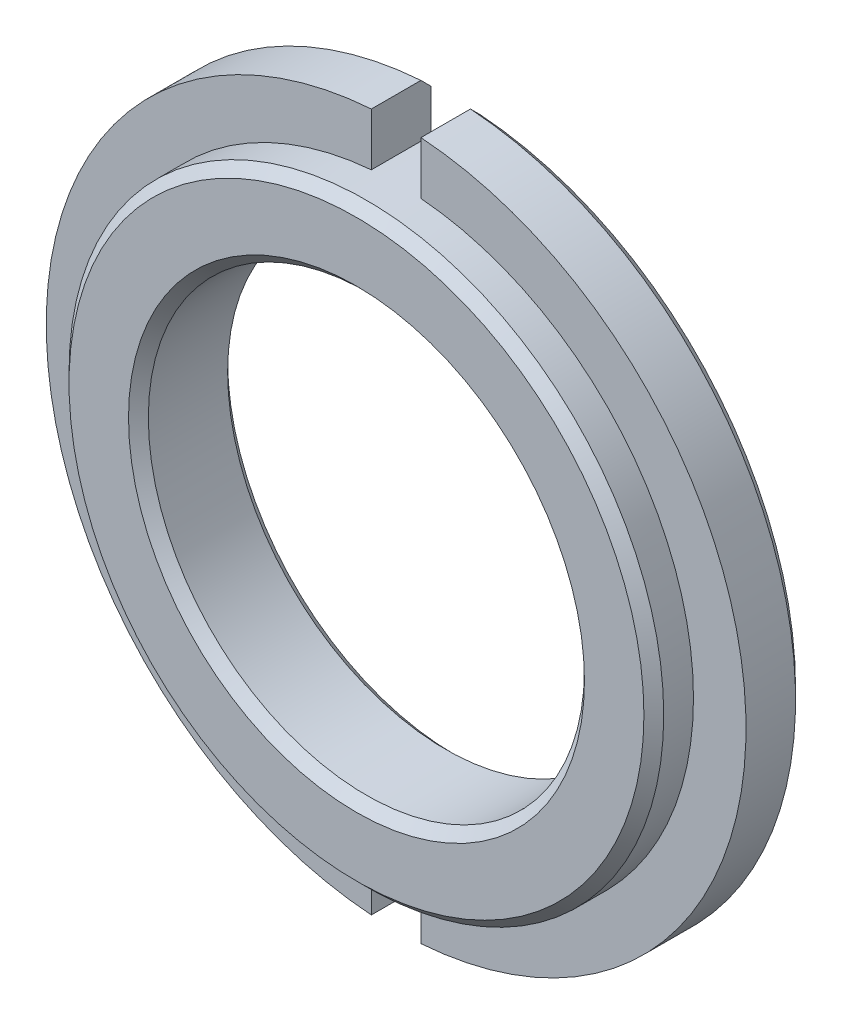
ISO-10303-21;
HEADER;
FILE_DESCRIPTION(('STEP AP214'),'2;1');
FILE_NAME('part.step','',(''),(''),'','','');
FILE_SCHEMA(('AUTOMOTIVE_DESIGN { 1 0 10303 214 1 1 1 1 }'));
ENDSEC;
DATA;
#1=APPLICATION_CONTEXT('core data for automotive mechanical design processes');
#2=APPLICATION_PROTOCOL_DEFINITION('international standard','automotive_design',2000,#1);
#3=PRODUCT_CONTEXT('',#1,'mechanical');
#4=PRODUCT('Part','Part','',(#3));
#5=PRODUCT_RELATED_PRODUCT_CATEGORY('part','',(#4));
#6=PRODUCT_DEFINITION_FORMATION('','',#4);
#7=PRODUCT_DEFINITION_CONTEXT('part definition',#1,'design');
#8=PRODUCT_DEFINITION('design','',#6,#7);
#9=PRODUCT_DEFINITION_SHAPE('','',#8);
#10=(LENGTH_UNIT() NAMED_UNIT(*) SI_UNIT(.MILLI.,.METRE.));
#11=(NAMED_UNIT(*) PLANE_ANGLE_UNIT() SI_UNIT($,.RADIAN.));
#12=(NAMED_UNIT(*) SI_UNIT($,.STERADIAN.) SOLID_ANGLE_UNIT());
#13=UNCERTAINTY_MEASURE_WITH_UNIT(LENGTH_MEASURE(1.E-05),#10,'distance_accuracy_value','');
#14=(GEOMETRIC_REPRESENTATION_CONTEXT(3) GLOBAL_UNCERTAINTY_ASSIGNED_CONTEXT((#13)) GLOBAL_UNIT_ASSIGNED_CONTEXT((#10,
#11,#12)) REPRESENTATION_CONTEXT('',''));
#15=CARTESIAN_POINT('',(0.,0.,0.));
#16=DIRECTION('',(0.,0.,1.));
#17=DIRECTION('',(1.,0.,0.));
#18=AXIS2_PLACEMENT_3D('',#15,#16,#17);
#19=CARTESIAN_POINT('',(0.,0.,5.));
#20=DIRECTION('',(0.,0.,-1.));
#21=DIRECTION('',(-1.,0.,0.));
#22=AXIS2_PLACEMENT_3D('',#19,#20,#21);
#23=CYLINDRICAL_SURFACE('',#22,17.65);
#24=DIRECTION('',(0.,0.,1.));
#25=VECTOR('',#24,1.);
#26=CARTESIAN_POINT('',(1.25,-17.6056809013455,-0.00100000000000013));
#27=LINE('',#26,#25);
#28=CARTESIAN_POINT('',(1.25,-17.6056809013455,0.500000000000005));
#29=VERTEX_POINT('',#28);
#30=CARTESIAN_POINT('',(1.25,-17.6056809013455,3.));
#31=VERTEX_POINT('',#30);
#32=EDGE_CURVE('E148',#29,#31,#27,.T.);
#33=ORIENTED_EDGE('',*,*,#32,.F.);
#34=CARTESIAN_POINT('',(0.,0.,0.5));
#35=DIRECTION('',(0.,0.,1.));
#36=DIRECTION('',(1.,0.,0.));
#37=AXIS2_PLACEMENT_3D('',#34,#35,#36);
#38=CIRCLE('',#37,17.65);
#39=CARTESIAN_POINT('',(1.25000000000001,17.6056809013455,0.500000000000005));
#40=VERTEX_POINT('',#39);
#41=EDGE_CURVE('E192',#29,#40,#38,.T.);
#42=ORIENTED_EDGE('',*,*,#41,.T.);
#43=DIRECTION('',(0.,0.,1.));
#44=VECTOR('',#43,1.);
#45=CARTESIAN_POINT('',(1.25000000000001,17.6056809013455,-0.00100000000000013));
#46=LINE('',#45,#44);
#47=CARTESIAN_POINT('',(1.25000000000001,17.6056809013455,3.));
#48=VERTEX_POINT('',#47);
#49=EDGE_CURVE('E166',#40,#48,#46,.T.);
#50=ORIENTED_EDGE('',*,*,#49,.T.);
#51=CARTESIAN_POINT('',(0.,0.,3.));
#52=DIRECTION('',(0.,0.,1.));
#53=DIRECTION('',(1.,0.,0.));
#54=AXIS2_PLACEMENT_3D('',#51,#52,#53);
#55=CIRCLE('',#54,17.65);
#56=EDGE_CURVE('E173',#31,#48,#55,.T.);
#57=ORIENTED_EDGE('',*,*,#56,.F.);
#58=EDGE_LOOP('',(#33,#42,#50,#57));
#59=FACE_BOUND('',#58,.T.);
#60=ADVANCED_FACE('F33',(#59),#23,.T.);
#61=CARTESIAN_POINT('',(0.,0.,3.));
#62=DIRECTION('',(0.,0.,1.));
#63=DIRECTION('',(1.,0.,0.));
#64=AXIS2_PLACEMENT_3D('',#61,#62,#63);
#65=PLANE('',#64);
#66=DIRECTION('',(0.,1.,0.));
#67=VECTOR('',#66,1.);
#68=CARTESIAN_POINT('',(1.25,-14.9478259288767,3.));
#69=LINE('',#68,#67);
#70=CARTESIAN_POINT('',(1.25,-14.9478259288767,3.));
#71=VERTEX_POINT('',#70);
#72=EDGE_CURVE('E135',#31,#71,#69,.T.);
#73=ORIENTED_EDGE('',*,*,#72,.F.);
#74=ORIENTED_EDGE('',*,*,#56,.T.);
#75=DIRECTION('',(0.,1.,0.));
#76=VECTOR('',#75,1.);
#77=CARTESIAN_POINT('',(1.25,17.6056809013455,3.));
#78=LINE('',#77,#76);
#79=CARTESIAN_POINT('',(1.25,14.9478259288767,3.));
#80=VERTEX_POINT('',#79);
#81=EDGE_CURVE('E155',#80,#48,#78,.T.);
#82=ORIENTED_EDGE('',*,*,#81,.F.);
#83=CARTESIAN_POINT('',(0.,0.,3.));
#84=DIRECTION('',(0.,0.,1.));
#85=DIRECTION('',(1.,0.,0.));
#86=AXIS2_PLACEMENT_3D('',#83,#84,#85);
#87=CIRCLE('',#86,15.);
#88=EDGE_CURVE('E171',#71,#80,#87,.T.);
#89=ORIENTED_EDGE('',*,*,#88,.F.);
#90=EDGE_LOOP('',(#73,#74,#82,#89));
#91=FACE_BOUND('',#90,.T.);
#92=ADVANCED_FACE('F224',(#91),#65,.T.);
#93=CARTESIAN_POINT('',(0.,0.,5.));
#94=DIRECTION('',(0.,0.,1.));
#95=DIRECTION('',(1.,0.,0.));
#96=AXIS2_PLACEMENT_3D('',#93,#94,#95);
#97=PLANE('',#96);
#98=CARTESIAN_POINT('',(0.,0.,5.));
#99=DIRECTION('',(0.,0.,1.));
#100=DIRECTION('',(1.,0.,0.));
#101=AXIS2_PLACEMENT_3D('',#98,#99,#100);
#102=CIRCLE('',#101,11.5);
#103=CARTESIAN_POINT('',(11.5,0.,5.));
#104=VERTEX_POINT('',#103);
#105=EDGE_CURVE('E186',#104,#104,#102,.F.);
#106=ORIENTED_EDGE('',*,*,#105,.T.);
#107=EDGE_LOOP('',(#106));
#108=FACE_BOUND('',#107,.T.);
#109=CARTESIAN_POINT('',(0.,0.,5.));
#110=DIRECTION('',(0.,0.,1.));
#111=DIRECTION('',(1.,0.,0.));
#112=AXIS2_PLACEMENT_3D('',#109,#110,#111);
#113=CIRCLE('',#112,14.5);
#114=CARTESIAN_POINT('',(14.5,0.,5.));
#115=VERTEX_POINT('',#114);
#116=EDGE_CURVE('E183',#115,#115,#113,.T.);
#117=ORIENTED_EDGE('',*,*,#116,.T.);
#118=EDGE_LOOP('',(#117));
#119=FACE_BOUND('',#118,.T.);
#120=ADVANCED_FACE('F228',(#108,#119),#97,.T.);
#121=DIRECTION('',(0.,0.,1.));
#122=VECTOR('',#121,1.);
#123=CARTESIAN_POINT('',(-1.25,17.6056809013455,-0.00100000000000013));
#124=LINE('',#123,#122);
#125=CARTESIAN_POINT('',(-1.25,17.6056809013455,0.500000000000005));
#126=VERTEX_POINT('',#125);
#127=CARTESIAN_POINT('',(-1.25,17.6056809013455,3.));
#128=VERTEX_POINT('',#127);
#129=EDGE_CURVE('E164',#126,#128,#124,.T.);
#130=ORIENTED_EDGE('',*,*,#129,.F.);
#131=CARTESIAN_POINT('',(0.,0.,0.5));
#132=DIRECTION('',(0.,0.,1.));
#133=DIRECTION('',(1.,0.,0.));
#134=AXIS2_PLACEMENT_3D('',#131,#132,#133);
#135=CIRCLE('',#134,17.65);
#136=CARTESIAN_POINT('',(-1.25,-17.6056809013455,0.500000000000005));
#137=VERTEX_POINT('',#136);
#138=EDGE_CURVE('E275',#126,#137,#135,.T.);
#139=ORIENTED_EDGE('',*,*,#138,.T.);
#140=DIRECTION('',(0.,0.,1.));
#141=VECTOR('',#140,1.);
#142=CARTESIAN_POINT('',(-1.25,-17.6056809013455,-0.00100000000000013));
#143=LINE('',#142,#141);
#144=CARTESIAN_POINT('',(-1.25,-17.6056809013455,3.));
#145=VERTEX_POINT('',#144);
#146=EDGE_CURVE('E134',#137,#145,#143,.T.);
#147=ORIENTED_EDGE('',*,*,#146,.T.);
#148=EDGE_CURVE('E174',#128,#145,#55,.T.);
#149=ORIENTED_EDGE('',*,*,#148,.F.);
#150=EDGE_LOOP('',(#130,#139,#147,#149));
#151=FACE_BOUND('',#150,.T.);
#152=ADVANCED_FACE('F231',(#151),#23,.T.);
#153=CARTESIAN_POINT('',(0.,0.,0.));
#154=DIRECTION('',(0.,0.,1.));
#155=DIRECTION('',(1.,0.,0.));
#156=AXIS2_PLACEMENT_3D('',#153,#154,#155);
#157=PLANE('',#156);
#158=CARTESIAN_POINT('',(0.,0.,0.));
#159=DIRECTION('',(0.,0.,1.));
#160=DIRECTION('',(1.,0.,0.));
#161=AXIS2_PLACEMENT_3D('',#158,#159,#160);
#162=CIRCLE('',#161,11.5);
#163=CARTESIAN_POINT('',(11.5,0.,0.));
#164=VERTEX_POINT('',#163);
#165=EDGE_CURVE('E202',#164,#164,#162,.T.);
#166=ORIENTED_EDGE('',*,*,#165,.T.);
#167=EDGE_LOOP('',(#166));
#168=FACE_BOUND('',#167,.T.);
#169=DIRECTION('',(0.,-1.,0.));
#170=VECTOR('',#169,1.);
#171=CARTESIAN_POINT('',(1.25,17.6056809013455,0.));
#172=LINE('',#171,#170);
#173=CARTESIAN_POINT('',(1.25,17.1043854025802,0.));
#174=VERTEX_POINT('',#173);
#175=CARTESIAN_POINT('',(1.25,14.9478259288767,0.));
#176=VERTEX_POINT('',#175);
#177=EDGE_CURVE('E163',#174,#176,#172,.T.);
#178=ORIENTED_EDGE('',*,*,#177,.F.);
#179=CARTESIAN_POINT('',(0.,0.,0.));
#180=DIRECTION('',(0.,0.,1.));
#181=DIRECTION('',(1.,0.,0.));
#182=AXIS2_PLACEMENT_3D('',#179,#180,#181);
#183=CIRCLE('',#182,17.15);
#184=CARTESIAN_POINT('',(1.25,-17.1043854025802,0.));
#185=VERTEX_POINT('',#184);
#186=EDGE_CURVE('E269',#174,#185,#183,.F.);
#187=ORIENTED_EDGE('',*,*,#186,.T.);
#188=DIRECTION('',(0.,-1.,0.));
#189=VECTOR('',#188,1.);
#190=CARTESIAN_POINT('',(1.25,-14.9478259288767,0.));
#191=LINE('',#190,#189);
#192=CARTESIAN_POINT('',(1.25,-14.9478259288767,0.));
#193=VERTEX_POINT('',#192);
#194=EDGE_CURVE('E140',#193,#185,#191,.T.);
#195=ORIENTED_EDGE('',*,*,#194,.F.);
#196=CARTESIAN_POINT('',(0.,0.,0.));
#197=DIRECTION('',(0.,0.,1.));
#198=DIRECTION('',(1.,0.,0.));
#199=AXIS2_PLACEMENT_3D('',#196,#197,#198);
#200=CIRCLE('',#199,15.);
#201=CARTESIAN_POINT('',(-1.25,-14.9478259288767,0.));
#202=VERTEX_POINT('',#201);
#203=EDGE_CURVE('E129',#202,#193,#200,.T.);
#204=ORIENTED_EDGE('',*,*,#203,.F.);
#205=DIRECTION('',(0.,1.,0.));
#206=VECTOR('',#205,1.);
#207=CARTESIAN_POINT('',(-1.25,-14.9478259288767,0.));
#208=LINE('',#207,#206);
#209=CARTESIAN_POINT('',(-1.25,-17.1043854025802,0.));
#210=VERTEX_POINT('',#209);
#211=EDGE_CURVE('E112',#210,#202,#208,.T.);
#212=ORIENTED_EDGE('',*,*,#211,.F.);
#213=CARTESIAN_POINT('',(0.,0.,0.));
#214=DIRECTION('',(0.,0.,1.));
#215=DIRECTION('',(1.,0.,0.));
#216=AXIS2_PLACEMENT_3D('',#213,#214,#215);
#217=CIRCLE('',#216,17.15);
#218=CARTESIAN_POINT('',(-1.25,17.1043854025802,0.));
#219=VERTEX_POINT('',#218);
#220=EDGE_CURVE('E278',#210,#219,#217,.F.);
#221=ORIENTED_EDGE('',*,*,#220,.T.);
#222=DIRECTION('',(0.,1.,0.));
#223=VECTOR('',#222,1.);
#224=CARTESIAN_POINT('',(-1.25,17.6056809013455,0.));
#225=LINE('',#224,#223);
#226=CARTESIAN_POINT('',(-1.25,14.9478259288767,0.));
#227=VERTEX_POINT('',#226);
#228=EDGE_CURVE('E153',#227,#219,#225,.T.);
#229=ORIENTED_EDGE('',*,*,#228,.F.);
#230=CARTESIAN_POINT('',(0.,0.,0.));
#231=DIRECTION('',(0.,0.,1.));
#232=DIRECTION('',(1.,0.,0.));
#233=AXIS2_PLACEMENT_3D('',#230,#231,#232);
#234=CIRCLE('',#233,15.);
#235=EDGE_CURVE('E121',#176,#227,#234,.T.);
#236=ORIENTED_EDGE('',*,*,#235,.F.);
#237=EDGE_LOOP('',(#178,#187,#195,#204,#212,#221,#229,#236));
#238=FACE_BOUND('',#237,.T.);
#239=ADVANCED_FACE('F138',(#168,#238),#157,.F.);
#240=CARTESIAN_POINT('',(0.,0.,5.));
#241=DIRECTION('',(0.,0.,-1.));
#242=DIRECTION('',(-1.,0.,0.));
#243=AXIS2_PLACEMENT_3D('',#240,#241,#242);
#244=CYLINDRICAL_SURFACE('',#243,11.);
#245=CARTESIAN_POINT('',(0.,0.,4.49999999999999));
#246=DIRECTION('',(0.,0.,1.));
#247=DIRECTION('',(1.,0.,0.));
#248=AXIS2_PLACEMENT_3D('',#245,#246,#247);
#249=CIRCLE('',#248,11.);
#250=CARTESIAN_POINT('',(11.,0.,4.49999999999999));
#251=VERTEX_POINT('',#250);
#252=EDGE_CURVE('E180',#251,#251,#249,.T.);
#253=ORIENTED_EDGE('',*,*,#252,.T.);
#254=EDGE_LOOP('',(#253));
#255=FACE_BOUND('',#254,.T.);
#256=CARTESIAN_POINT('',(0.,0.,0.499999999999995));
#257=DIRECTION('',(0.,0.,1.));
#258=DIRECTION('',(1.,0.,0.));
#259=AXIS2_PLACEMENT_3D('',#256,#257,#258);
#260=CIRCLE('',#259,11.);
#261=CARTESIAN_POINT('',(11.,0.,0.499999999999995));
#262=VERTEX_POINT('',#261);
#263=EDGE_CURVE('E177',#262,#262,#260,.F.);
#264=ORIENTED_EDGE('',*,*,#263,.T.);
#265=EDGE_LOOP('',(#264));
#266=FACE_BOUND('',#265,.T.);
#267=ADVANCED_FACE('F222',(#255,#266),#244,.F.);
#268=DIRECTION('',(0.,-1.,0.));
#269=VECTOR('',#268,1.);
#270=CARTESIAN_POINT('',(-1.25,-14.9478259288767,3.));
#271=LINE('',#270,#269);
#272=CARTESIAN_POINT('',(-1.25,-14.9478259288767,3.));
#273=VERTEX_POINT('',#272);
#274=EDGE_CURVE('E142',#273,#145,#271,.T.);
#275=ORIENTED_EDGE('',*,*,#274,.F.);
#276=CARTESIAN_POINT('',(-1.25,14.9478259288767,3.));
#277=VERTEX_POINT('',#276);
#278=EDGE_CURVE('E133',#277,#273,#87,.T.);
#279=ORIENTED_EDGE('',*,*,#278,.F.);
#280=DIRECTION('',(0.,-1.,0.));
#281=VECTOR('',#280,1.);
#282=CARTESIAN_POINT('',(-1.25,17.6056809013455,3.));
#283=LINE('',#282,#281);
#284=EDGE_CURVE('E158',#128,#277,#283,.T.);
#285=ORIENTED_EDGE('',*,*,#284,.F.);
#286=ORIENTED_EDGE('',*,*,#148,.T.);
#287=EDGE_LOOP('',(#275,#279,#285,#286));
#288=FACE_BOUND('',#287,.T.);
#289=ADVANCED_FACE('F218',(#288),#65,.T.);
#290=CARTESIAN_POINT('',(0.,0.,3.));
#291=DIRECTION('',(0.,0.,1.));
#292=DIRECTION('',(1.,0.,0.));
#293=AXIS2_PLACEMENT_3D('',#290,#291,#292);
#294=CYLINDRICAL_SURFACE('',#293,15.);
#295=CARTESIAN_POINT('',(0.,0.,4.5));
#296=DIRECTION('',(0.,0.,1.));
#297=DIRECTION('',(1.,0.,0.));
#298=AXIS2_PLACEMENT_3D('',#295,#296,#297);
#299=CIRCLE('',#298,15.);
#300=CARTESIAN_POINT('',(15.,0.,4.5));
#301=VERTEX_POINT('',#300);
#302=EDGE_CURVE('E189',#301,#301,#299,.F.);
#303=ORIENTED_EDGE('',*,*,#302,.T.);
#304=EDGE_LOOP('',(#303));
#305=FACE_BOUND('',#304,.T.);
#306=ORIENTED_EDGE('',*,*,#278,.T.);
#307=DIRECTION('',(0.,0.,1.));
#308=VECTOR('',#307,1.);
#309=CARTESIAN_POINT('',(-1.25,-14.9478259288767,-0.00100000000000013));
#310=LINE('',#309,#308);
#311=EDGE_CURVE('E117',#202,#273,#310,.T.);
#312=ORIENTED_EDGE('',*,*,#311,.F.);
#313=ORIENTED_EDGE('',*,*,#203,.T.);
#314=DIRECTION('',(0.,0.,1.));
#315=VECTOR('',#314,1.);
#316=CARTESIAN_POINT('',(1.25,-14.9478259288767,-0.00100000000000013));
#317=LINE('',#316,#315);
#318=EDGE_CURVE('E122',#193,#71,#317,.T.);
#319=ORIENTED_EDGE('',*,*,#318,.T.);
#320=ORIENTED_EDGE('',*,*,#88,.T.);
#321=DIRECTION('',(0.,0.,1.));
#322=VECTOR('',#321,1.);
#323=CARTESIAN_POINT('',(1.25,14.9478259288767,-0.00100000000000013));
#324=LINE('',#323,#322);
#325=EDGE_CURVE('E160',#176,#80,#324,.T.);
#326=ORIENTED_EDGE('',*,*,#325,.F.);
#327=ORIENTED_EDGE('',*,*,#235,.T.);
#328=DIRECTION('',(0.,0.,1.));
#329=VECTOR('',#328,1.);
#330=CARTESIAN_POINT('',(-1.25,14.9478259288767,-0.00100000000000013));
#331=LINE('',#330,#329);
#332=EDGE_CURVE('E161',#227,#277,#331,.T.);
#333=ORIENTED_EDGE('',*,*,#332,.T.);
#334=EDGE_LOOP('',(#306,#312,#313,#319,#320,#326,#327,#333));
#335=FACE_BOUND('',#334,.T.);
#336=ADVANCED_FACE('F127',(#305,#335),#294,.T.);
#337=CARTESIAN_POINT('',(-1.25,17.6056809013455,-0.00100000000000013));
#338=DIRECTION('',(-1.,0.,0.));
#339=DIRECTION('',(0.,0.,1.));
#340=AXIS2_PLACEMENT_3D('',#337,#338,#339);
#341=PLANE('',#340);
#342=ORIENTED_EDGE('',*,*,#228,.T.);
#343=CARTESIAN_POINT('',(-1.25,17.1043854025802,0.));
#344=CARTESIAN_POINT('',(-1.25,17.1879377586314,0.0833302190288848));
#345=CARTESIAN_POINT('',(-1.25,17.2714885615543,0.166661995210202));
#346=CARTESIAN_POINT('',(-1.25,17.4385870611427,0.333328661876869));
#347=CARTESIAN_POINT('',(-1.25,17.5221347578082,0.416663552362218));
#348=CARTESIAN_POINT('',(-1.25,17.6056809013454,0.5));
#349=B_SPLINE_CURVE_WITH_KNOTS('',3,(#343,#344,#345,#346,#347,#348),.UNSPECIFIED.,.F.,.F.,(4,2,
4),(0.,0.354011714940833,0.708023429878131),.UNSPECIFIED.);
#350=EDGE_CURVE('E11',#219,#126,#349,.T.);
#351=ORIENTED_EDGE('',*,*,#350,.T.);
#352=ORIENTED_EDGE('',*,*,#129,.T.);
#353=ORIENTED_EDGE('',*,*,#284,.T.);
#354=ORIENTED_EDGE('',*,*,#332,.F.);
#355=EDGE_LOOP('',(#342,#351,#352,#353,#354));
#356=FACE_BOUND('',#355,.T.);
#357=ADVANCED_FACE('F212',(#356),#341,.F.);
#358=CARTESIAN_POINT('',(1.25,17.6056809013455,-0.00100000000000013));
#359=DIRECTION('',(1.,0.,0.));
#360=DIRECTION('',(0.,0.,-1.));
#361=AXIS2_PLACEMENT_3D('',#358,#359,#360);
#362=PLANE('',#361);
#363=ORIENTED_EDGE('',*,*,#49,.F.);
#364=CARTESIAN_POINT('',(1.25000000000001,17.6056809013454,0.5));
#365=CARTESIAN_POINT('',(1.25000000000001,17.5221347578082,0.416663552362219));
#366=CARTESIAN_POINT('',(1.25,17.4385870611427,0.333328661876869));
#367=CARTESIAN_POINT('',(1.25,17.2714885615543,0.166661995210202));
#368=CARTESIAN_POINT('',(1.25,17.1879377586314,0.0833302190288852));
#369=CARTESIAN_POINT('',(1.25,17.1043854025802,0.));
#370=B_SPLINE_CURVE_WITH_KNOTS('',3,(#364,#365,#366,#367,#368,#369),.UNSPECIFIED.,.F.,.F.,(4,2,
4),(0.,0.354011714937298,0.708023429878131),.UNSPECIFIED.);
#371=EDGE_CURVE('E195',#40,#174,#370,.T.);
#372=ORIENTED_EDGE('',*,*,#371,.T.);
#373=ORIENTED_EDGE('',*,*,#177,.T.);
#374=ORIENTED_EDGE('',*,*,#325,.T.);
#375=ORIENTED_EDGE('',*,*,#81,.T.);
#376=EDGE_LOOP('',(#363,#372,#373,#374,#375));
#377=FACE_BOUND('',#376,.T.);
#378=ADVANCED_FACE('F207',(#377),#362,.F.);
#379=CARTESIAN_POINT('',(1.25,-14.9478259288767,-0.00100000000000013));
#380=DIRECTION('',(1.,0.,0.));
#381=DIRECTION('',(0.,0.,-1.));
#382=AXIS2_PLACEMENT_3D('',#379,#380,#381);
#383=PLANE('',#382);
#384=ORIENTED_EDGE('',*,*,#194,.T.);
#385=CARTESIAN_POINT('',(1.25,-17.1043854025802,0.));
#386=CARTESIAN_POINT('',(1.25,-17.1879377586314,0.0833302190288848));
#387=CARTESIAN_POINT('',(1.25,-17.2714885615543,0.166661995210202));
#388=CARTESIAN_POINT('',(1.25,-17.4385870611427,0.333328661876869));
#389=CARTESIAN_POINT('',(1.25,-17.5221347578082,0.416663552362218));
#390=CARTESIAN_POINT('',(1.25,-17.6056809013454,0.5));
#391=B_SPLINE_CURVE_WITH_KNOTS('',3,(#385,#386,#387,#388,#389,#390),.UNSPECIFIED.,.F.,.F.,(4,2,
4),(0.,0.354011714940833,0.708023429878131),.UNSPECIFIED.);
#392=EDGE_CURVE('E268',#185,#29,#391,.T.);
#393=ORIENTED_EDGE('',*,*,#392,.T.);
#394=ORIENTED_EDGE('',*,*,#32,.T.);
#395=ORIENTED_EDGE('',*,*,#72,.T.);
#396=ORIENTED_EDGE('',*,*,#318,.F.);
#397=EDGE_LOOP('',(#384,#393,#394,#395,#396));
#398=FACE_BOUND('',#397,.T.);
#399=ADVANCED_FACE('F211',(#398),#383,.F.);
#400=CARTESIAN_POINT('',(-1.25,-14.9478259288767,-0.00100000000000013));
#401=DIRECTION('',(-1.,0.,0.));
#402=DIRECTION('',(0.,0.,1.));
#403=AXIS2_PLACEMENT_3D('',#400,#401,#402);
#404=PLANE('',#403);
#405=ORIENTED_EDGE('',*,*,#146,.F.);
#406=CARTESIAN_POINT('',(-1.25,-17.6056809013454,0.5));
#407=CARTESIAN_POINT('',(-1.25,-17.5221347578082,0.416663552362219));
#408=CARTESIAN_POINT('',(-1.25,-17.4385870611427,0.333328661876869));
#409=CARTESIAN_POINT('',(-1.25,-17.2714885615543,0.166661995210202));
#410=CARTESIAN_POINT('',(-1.25,-17.1879377586314,0.0833302190288852));
#411=CARTESIAN_POINT('',(-1.25,-17.1043854025802,0.));
#412=B_SPLINE_CURVE_WITH_KNOTS('',3,(#406,#407,#408,#409,#410,#411),.UNSPECIFIED.,.F.,.F.,(4,2,
4),(0.,0.354011714937298,0.70802342987813),.UNSPECIFIED.);
#413=EDGE_CURVE('E45',#137,#210,#412,.T.);
#414=ORIENTED_EDGE('',*,*,#413,.T.);
#415=ORIENTED_EDGE('',*,*,#211,.T.);
#416=ORIENTED_EDGE('',*,*,#311,.T.);
#417=ORIENTED_EDGE('',*,*,#274,.T.);
#418=EDGE_LOOP('',(#405,#414,#415,#416,#417));
#419=FACE_BOUND('',#418,.T.);
#420=ADVANCED_FACE('F115',(#419),#404,.F.);
#421=CARTESIAN_POINT('',(0.,0.,4.49999999999999));
#422=DIRECTION('',(0.,0.,1.));
#423=DIRECTION('',(1.,0.,0.));
#424=AXIS2_PLACEMENT_3D('',#421,#422,#423);
#425=CONICAL_SURFACE('',#424,11.,0.785398163397447);
#426=ORIENTED_EDGE('',*,*,#105,.F.);
#427=EDGE_LOOP('',(#426));
#428=FACE_BOUND('',#427,.T.);
#429=ORIENTED_EDGE('',*,*,#252,.F.);
#430=EDGE_LOOP('',(#429));
#431=FACE_BOUND('',#430,.T.);
#432=ADVANCED_FACE('F239',(#428,#431),#425,.F.);
#433=CARTESIAN_POINT('',(0.,0.,5.));
#434=DIRECTION('',(0.,0.,-1.));
#435=DIRECTION('',(-1.,0.,0.));
#436=AXIS2_PLACEMENT_3D('',#433,#434,#435);
#437=CONICAL_SURFACE('',#436,14.5,0.785398163397448);
#438=ORIENTED_EDGE('',*,*,#302,.F.);
#439=EDGE_LOOP('',(#438));
#440=FACE_BOUND('',#439,.T.);
#441=ORIENTED_EDGE('',*,*,#116,.F.);
#442=EDGE_LOOP('',(#441));
#443=FACE_BOUND('',#442,.T.);
#444=ADVANCED_FACE('F241',(#440,#443),#437,.T.);
#445=CARTESIAN_POINT('',(0.,0.,0.5));
#446=DIRECTION('',(0.,0.,1.));
#447=DIRECTION('',(1.,0.,0.));
#448=AXIS2_PLACEMENT_3D('',#445,#446,#447);
#449=CONICAL_SURFACE('',#448,17.65,0.785398163397448);
#450=ORIENTED_EDGE('',*,*,#392,.F.);
#451=ORIENTED_EDGE('',*,*,#186,.F.);
#452=ORIENTED_EDGE('',*,*,#371,.F.);
#453=ORIENTED_EDGE('',*,*,#41,.F.);
#454=EDGE_LOOP('',(#450,#451,#452,#453));
#455=FACE_BOUND('',#454,.T.);
#456=ADVANCED_FACE('F204',(#455),#449,.T.);
#457=CARTESIAN_POINT('',(0.,0.,0.5));
#458=DIRECTION('',(0.,0.,1.));
#459=DIRECTION('',(1.,0.,0.));
#460=AXIS2_PLACEMENT_3D('',#457,#458,#459);
#461=CONICAL_SURFACE('',#460,17.65,0.785398163397448);
#462=ORIENTED_EDGE('',*,*,#350,.F.);
#463=ORIENTED_EDGE('',*,*,#220,.F.);
#464=ORIENTED_EDGE('',*,*,#413,.F.);
#465=ORIENTED_EDGE('',*,*,#138,.F.);
#466=EDGE_LOOP('',(#462,#463,#464,#465));
#467=FACE_BOUND('',#466,.T.);
#468=ADVANCED_FACE('F248',(#467),#461,.T.);
#469=CARTESIAN_POINT('',(0.,0.,0.));
#470=DIRECTION('',(0.,0.,-1.));
#471=DIRECTION('',(-1.,0.,0.));
#472=AXIS2_PLACEMENT_3D('',#469,#470,#471);
#473=CONICAL_SURFACE('',#472,11.5,0.785398163397447);
#474=ORIENTED_EDGE('',*,*,#263,.F.);
#475=EDGE_LOOP('',(#474));
#476=FACE_BOUND('',#475,.T.);
#477=ORIENTED_EDGE('',*,*,#165,.F.);
#478=EDGE_LOOP('',(#477));
#479=FACE_BOUND('',#478,.T.);
#480=ADVANCED_FACE('F35',(#476,#479),#473,.F.);
#481=CLOSED_SHELL('',(#60,#92,#120,#152,#239,#267,#289,#336,#357,#378,#399,#420,#432,#444,#456,
#468,#480));
#482=MANIFOLD_SOLID_BREP('B2',#481);
#483=ADVANCED_BREP_SHAPE_REPRESENTATION('',(#18,#482),#14);
#484=SHAPE_DEFINITION_REPRESENTATION(#9,#483);
ENDSEC;
END-ISO-10303-21;
